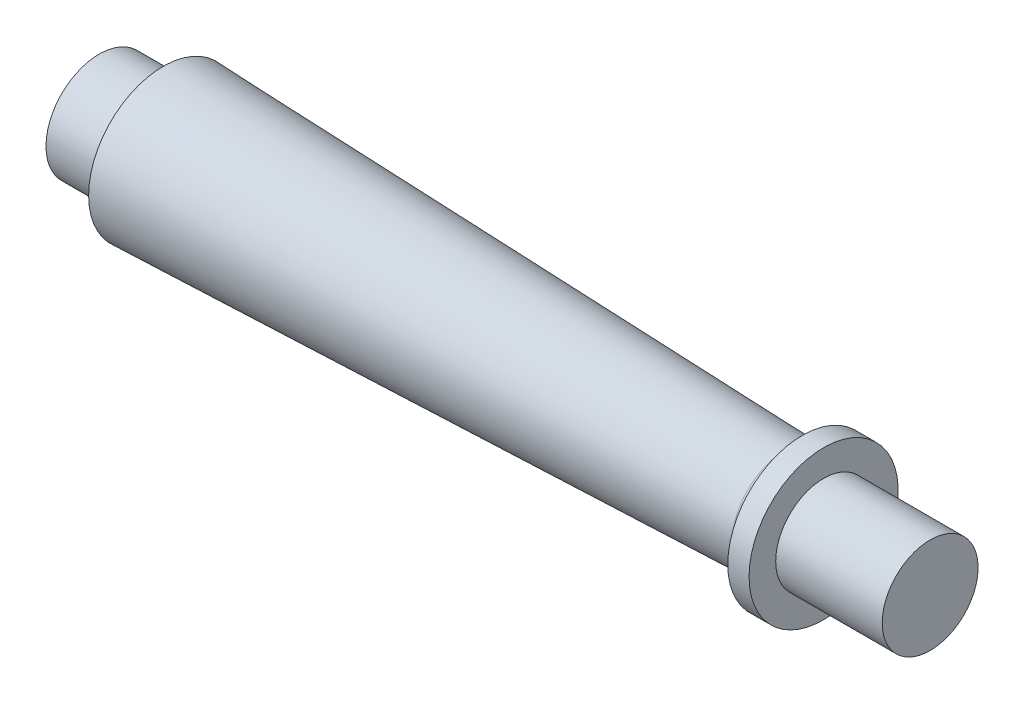
ISO-10303-21;
HEADER;
FILE_DESCRIPTION(('STEP AP214'),'2;1');
FILE_NAME('part.step','',(''),(''),'','','');
FILE_SCHEMA(('AUTOMOTIVE_DESIGN { 1 0 10303 214 1 1 1 1 }'));
ENDSEC;
DATA;
#1=APPLICATION_CONTEXT('core data for automotive mechanical design processes');
#2=APPLICATION_PROTOCOL_DEFINITION('international standard','automotive_design',2000,#1);
#3=PRODUCT_CONTEXT('',#1,'mechanical');
#4=PRODUCT('Part','Part','',(#3));
#5=PRODUCT_RELATED_PRODUCT_CATEGORY('part','',(#4));
#6=PRODUCT_DEFINITION_FORMATION('','',#4);
#7=PRODUCT_DEFINITION_CONTEXT('part definition',#1,'design');
#8=PRODUCT_DEFINITION('design','',#6,#7);
#9=PRODUCT_DEFINITION_SHAPE('','',#8);
#10=(LENGTH_UNIT() NAMED_UNIT(*) SI_UNIT(.MILLI.,.METRE.));
#11=(NAMED_UNIT(*) PLANE_ANGLE_UNIT() SI_UNIT($,.RADIAN.));
#12=(NAMED_UNIT(*) SI_UNIT($,.STERADIAN.) SOLID_ANGLE_UNIT());
#13=UNCERTAINTY_MEASURE_WITH_UNIT(LENGTH_MEASURE(1.E-05),#10,'distance_accuracy_value','');
#14=(GEOMETRIC_REPRESENTATION_CONTEXT(3) GLOBAL_UNCERTAINTY_ASSIGNED_CONTEXT((#13)) GLOBAL_UNIT_ASSIGNED_CONTEXT((#10,
#11,#12)) REPRESENTATION_CONTEXT('',''));
#15=CARTESIAN_POINT('',(0.,0.,0.));
#16=DIRECTION('',(0.,0.,1.));
#17=DIRECTION('',(1.,0.,0.));
#18=AXIS2_PLACEMENT_3D('',#15,#16,#17);
#19=CARTESIAN_POINT('',(0.,5.,0.));
#20=DIRECTION('',(1.,0.,0.));
#21=DIRECTION('',(0.,0.,-1.));
#22=AXIS2_PLACEMENT_3D('',#19,#20,#21);
#23=PLANE('',#22);
#24=CARTESIAN_POINT('',(0.,0.,0.));
#25=DIRECTION('',(-1.,0.,0.));
#26=DIRECTION('',(0.,0.,1.));
#27=AXIS2_PLACEMENT_3D('',#24,#25,#26);
#28=CIRCLE('',#27,5.);
#29=CARTESIAN_POINT('',(0.,0.,5.));
#30=VERTEX_POINT('',#29);
#31=EDGE_CURVE('E64',#30,#30,#28,.T.);
#32=ORIENTED_EDGE('',*,*,#31,.T.);
#33=EDGE_LOOP('',(#32));
#34=FACE_BOUND('',#33,.T.);
#35=ADVANCED_FACE('F32',(#34),#23,.F.);
#36=CARTESIAN_POINT('',(78.,0.,0.));
#37=DIRECTION('',(-1.,0.,0.));
#38=DIRECTION('',(0.,0.,1.));
#39=AXIS2_PLACEMENT_3D('',#36,#37,#38);
#40=PLANE('',#39);
#41=CARTESIAN_POINT('',(78.,0.,0.));
#42=DIRECTION('',(-1.,0.,0.));
#43=DIRECTION('',(0.,0.,1.));
#44=AXIS2_PLACEMENT_3D('',#41,#42,#43);
#45=CIRCLE('',#44,4.5);
#46=CARTESIAN_POINT('',(78.,0.,4.5));
#47=VERTEX_POINT('',#46);
#48=EDGE_CURVE('E43',#47,#47,#45,.T.);
#49=ORIENTED_EDGE('',*,*,#48,.F.);
#50=EDGE_LOOP('',(#49));
#51=FACE_BOUND('',#50,.T.);
#52=ADVANCED_FACE('F91',(#51),#40,.F.);
#53=CARTESIAN_POINT('',(0.,0.,0.));
#54=DIRECTION('',(-1.,0.,0.));
#55=DIRECTION('',(0.,0.,1.));
#56=AXIS2_PLACEMENT_3D('',#53,#54,#55);
#57=CYLINDRICAL_SURFACE('',#56,4.5);
#58=CARTESIAN_POINT('',(68.,0.,0.));
#59=DIRECTION('',(-1.,0.,0.));
#60=DIRECTION('',(0.,0.,1.));
#61=AXIS2_PLACEMENT_3D('',#58,#59,#60);
#62=CIRCLE('',#61,4.5);
#63=CARTESIAN_POINT('',(68.,0.,4.5));
#64=VERTEX_POINT('',#63);
#65=EDGE_CURVE('E47',#64,#64,#62,.T.);
#66=ORIENTED_EDGE('',*,*,#65,.F.);
#67=EDGE_LOOP('',(#66));
#68=FACE_BOUND('',#67,.T.);
#69=ORIENTED_EDGE('',*,*,#48,.T.);
#70=EDGE_LOOP('',(#69));
#71=FACE_BOUND('',#70,.T.);
#72=ADVANCED_FACE('F95',(#68,#71),#57,.T.);
#73=CARTESIAN_POINT('',(68.,4.5,0.));
#74=DIRECTION('',(-1.,0.,0.));
#75=DIRECTION('',(0.,0.,1.));
#76=AXIS2_PLACEMENT_3D('',#73,#74,#75);
#77=PLANE('',#76);
#78=CARTESIAN_POINT('',(68.,0.,0.));
#79=DIRECTION('',(-1.,0.,0.));
#80=DIRECTION('',(0.,0.,1.));
#81=AXIS2_PLACEMENT_3D('',#78,#79,#80);
#82=CIRCLE('',#81,7.);
#83=CARTESIAN_POINT('',(68.,0.,7.));
#84=VERTEX_POINT('',#83);
#85=EDGE_CURVE('E52',#84,#84,#82,.T.);
#86=ORIENTED_EDGE('',*,*,#85,.F.);
#87=EDGE_LOOP('',(#86));
#88=FACE_BOUND('',#87,.T.);
#89=ORIENTED_EDGE('',*,*,#65,.T.);
#90=EDGE_LOOP('',(#89));
#91=FACE_BOUND('',#90,.T.);
#92=ADVANCED_FACE('F101',(#88,#91),#77,.F.);
#93=CARTESIAN_POINT('',(0.,0.,0.));
#94=DIRECTION('',(-1.,0.,0.));
#95=DIRECTION('',(0.,0.,1.));
#96=AXIS2_PLACEMENT_3D('',#93,#94,#95);
#97=CYLINDRICAL_SURFACE('',#96,7.);
#98=CARTESIAN_POINT('',(66.,0.,0.));
#99=DIRECTION('',(-1.,0.,0.));
#100=DIRECTION('',(0.,0.,1.));
#101=AXIS2_PLACEMENT_3D('',#98,#99,#100);
#102=CIRCLE('',#101,7.);
#103=CARTESIAN_POINT('',(66.,0.,7.));
#104=VERTEX_POINT('',#103);
#105=EDGE_CURVE('E55',#104,#104,#102,.T.);
#106=ORIENTED_EDGE('',*,*,#105,.F.);
#107=EDGE_LOOP('',(#106));
#108=FACE_BOUND('',#107,.T.);
#109=ORIENTED_EDGE('',*,*,#85,.T.);
#110=EDGE_LOOP('',(#109));
#111=FACE_BOUND('',#110,.T.);
#112=ADVANCED_FACE('F88',(#108,#111),#97,.T.);
#113=CARTESIAN_POINT('',(66.,7.,0.));
#114=DIRECTION('',(1.,0.,0.));
#115=DIRECTION('',(0.,0.,-1.));
#116=AXIS2_PLACEMENT_3D('',#113,#114,#115);
#117=PLANE('',#116);
#118=CARTESIAN_POINT('',(66.,0.,0.));
#119=DIRECTION('',(1.,0.,0.));
#120=DIRECTION('',(0.,0.,-1.));
#121=AXIS2_PLACEMENT_3D('',#118,#119,#120);
#122=CIRCLE('',#121,6.55083310198036);
#123=CARTESIAN_POINT('',(66.,0.,-6.55083310198036));
#124=VERTEX_POINT('',#123);
#125=EDGE_CURVE('E10',#124,#124,#122,.T.);
#126=ORIENTED_EDGE('',*,*,#125,.T.);
#127=EDGE_LOOP('',(#126));
#128=FACE_BOUND('',#127,.T.);
#129=ORIENTED_EDGE('',*,*,#105,.T.);
#130=EDGE_LOOP('',(#129));
#131=FACE_BOUND('',#130,.T.);
#132=ADVANCED_FACE('F83',(#128,#131),#117,.F.);
#133=CARTESIAN_POINT('',(66.,0.,0.));
#134=DIRECTION('',(-1.,0.,0.));
#135=DIRECTION('',(0.,0.,1.));
#136=AXIS2_PLACEMENT_3D('',#133,#134,#135);
#137=CONICAL_SURFACE('',#136,5.,0.0333209958782472);
#138=CARTESIAN_POINT('',(64.450027754651,0.,0.));
#139=DIRECTION('',(-1.,0.,0.));
#140=DIRECTION('',(0.,0.,1.));
#141=AXIS2_PLACEMENT_3D('',#138,#139,#140);
#142=CIRCLE('',#141,5.05166574151163);
#143=CARTESIAN_POINT('',(64.450027754651,0.,5.05166574151163));
#144=VERTEX_POINT('',#143);
#145=EDGE_CURVE('E39',#144,#144,#142,.T.);
#146=ORIENTED_EDGE('',*,*,#145,.T.);
#147=EDGE_LOOP('',(#146));
#148=FACE_BOUND('',#147,.T.);
#149=CARTESIAN_POINT('',(6.,0.,0.));
#150=DIRECTION('',(-1.,0.,0.));
#151=DIRECTION('',(0.,0.,1.));
#152=AXIS2_PLACEMENT_3D('',#149,#150,#151);
#153=CIRCLE('',#152,7.);
#154=CARTESIAN_POINT('',(6.,0.,7.));
#155=VERTEX_POINT('',#154);
#156=EDGE_CURVE('E58',#155,#155,#153,.T.);
#157=ORIENTED_EDGE('',*,*,#156,.F.);
#158=EDGE_LOOP('',(#157));
#159=FACE_BOUND('',#158,.T.);
#160=ADVANCED_FACE('F78',(#148,#159),#137,.T.);
#161=CARTESIAN_POINT('',(6.,7.,0.));
#162=DIRECTION('',(1.,0.,0.));
#163=DIRECTION('',(0.,0.,-1.));
#164=AXIS2_PLACEMENT_3D('',#161,#162,#163);
#165=PLANE('',#164);
#166=CARTESIAN_POINT('',(6.,0.,0.));
#167=DIRECTION('',(-1.,0.,0.));
#168=DIRECTION('',(0.,0.,1.));
#169=AXIS2_PLACEMENT_3D('',#166,#167,#168);
#170=CIRCLE('',#169,5.);
#171=CARTESIAN_POINT('',(6.,0.,5.));
#172=VERTEX_POINT('',#171);
#173=EDGE_CURVE('E61',#172,#172,#170,.T.);
#174=ORIENTED_EDGE('',*,*,#173,.F.);
#175=EDGE_LOOP('',(#174));
#176=FACE_BOUND('',#175,.T.);
#177=ORIENTED_EDGE('',*,*,#156,.T.);
#178=EDGE_LOOP('',(#177));
#179=FACE_BOUND('',#178,.T.);
#180=ADVANCED_FACE('F72',(#176,#179),#165,.F.);
#181=CARTESIAN_POINT('',(0.,0.,0.));
#182=DIRECTION('',(-1.,0.,0.));
#183=DIRECTION('',(0.,0.,1.));
#184=AXIS2_PLACEMENT_3D('',#181,#182,#183);
#185=CYLINDRICAL_SURFACE('',#184,5.);
#186=ORIENTED_EDGE('',*,*,#31,.F.);
#187=EDGE_LOOP('',(#186));
#188=FACE_BOUND('',#187,.T.);
#189=ORIENTED_EDGE('',*,*,#173,.T.);
#190=EDGE_LOOP('',(#189));
#191=FACE_BOUND('',#190,.T.);
#192=ADVANCED_FACE('F69',(#188,#191),#185,.T.);
#193=CARTESIAN_POINT('',(64.5,0.,0.));
#194=DIRECTION('',(1.,0.,0.));
#195=DIRECTION('',(0.,0.,-1.));
#196=AXIS2_PLACEMENT_3D('',#193,#194,#195);
#197=TOROIDAL_SURFACE('',#196,6.55083310198036,1.5);
#198=ORIENTED_EDGE('',*,*,#125,.F.);
#199=EDGE_LOOP('',(#198));
#200=FACE_BOUND('',#199,.T.);
#201=ORIENTED_EDGE('',*,*,#145,.F.);
#202=EDGE_LOOP('',(#201));
#203=FACE_BOUND('',#202,.T.);
#204=ADVANCED_FACE('F34',(#200,#203),#197,.F.);
#205=CLOSED_SHELL('',(#35,#52,#72,#92,#112,#132,#160,#180,#192,#204));
#206=MANIFOLD_SOLID_BREP('B2',#205);
#207=ADVANCED_BREP_SHAPE_REPRESENTATION('',(#18,#206),#14);
#208=SHAPE_DEFINITION_REPRESENTATION(#9,#207);
ENDSEC;
END-ISO-10303-21;
